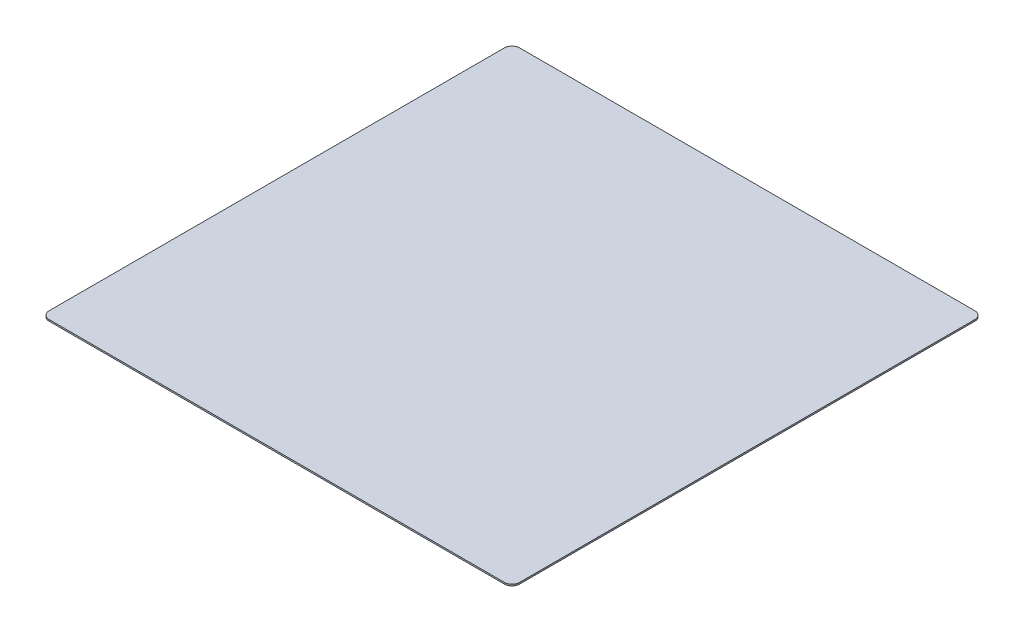
ISO-10303-21;
HEADER;
FILE_DESCRIPTION(('STEP AP214'),'2;1');
FILE_NAME('part.step','',(''),(''),'','','');
FILE_SCHEMA(('AUTOMOTIVE_DESIGN { 1 0 10303 214 1 1 1 1 }'));
ENDSEC;
DATA;
#1=APPLICATION_CONTEXT('core data for automotive mechanical design processes');
#2=APPLICATION_PROTOCOL_DEFINITION('international standard','automotive_design',2000,#1);
#3=PRODUCT_CONTEXT('',#1,'mechanical');
#4=PRODUCT('Part','Part','',(#3));
#5=PRODUCT_RELATED_PRODUCT_CATEGORY('part','',(#4));
#6=PRODUCT_DEFINITION_FORMATION('','',#4);
#7=PRODUCT_DEFINITION_CONTEXT('part definition',#1,'design');
#8=PRODUCT_DEFINITION('design','',#6,#7);
#9=PRODUCT_DEFINITION_SHAPE('','',#8);
#10=(LENGTH_UNIT() NAMED_UNIT(*) SI_UNIT(.MILLI.,.METRE.));
#11=(NAMED_UNIT(*) PLANE_ANGLE_UNIT() SI_UNIT($,.RADIAN.));
#12=(NAMED_UNIT(*) SI_UNIT($,.STERADIAN.) SOLID_ANGLE_UNIT());
#13=UNCERTAINTY_MEASURE_WITH_UNIT(LENGTH_MEASURE(1.E-05),#10,'distance_accuracy_value','');
#14=(GEOMETRIC_REPRESENTATION_CONTEXT(3) GLOBAL_UNCERTAINTY_ASSIGNED_CONTEXT((#13)) GLOBAL_UNIT_ASSIGNED_CONTEXT((#10,
#11,#12)) REPRESENTATION_CONTEXT('',''));
#15=CARTESIAN_POINT('',(0.,0.,0.));
#16=DIRECTION('',(0.,0.,1.));
#17=DIRECTION('',(1.,0.,0.));
#18=AXIS2_PLACEMENT_3D('',#15,#16,#17);
#19=CARTESIAN_POINT('',(-150.,1.,150.));
#20=DIRECTION('',(0.,-1.,0.));
#21=DIRECTION('',(0.,0.,-1.));
#22=AXIS2_PLACEMENT_3D('',#19,#20,#21);
#23=CYLINDRICAL_SURFACE('',#22,5.);
#24=CARTESIAN_POINT('',(-150.,0.,150.));
#25=DIRECTION('',(0.,1.,0.));
#26=DIRECTION('',(0.,0.,1.));
#27=AXIS2_PLACEMENT_3D('',#24,#25,#26);
#28=CIRCLE('',#27,5.);
#29=CARTESIAN_POINT('',(-155.,0.,150.));
#30=VERTEX_POINT('',#29);
#31=CARTESIAN_POINT('',(-150.,0.,155.));
#32=VERTEX_POINT('',#31);
#33=EDGE_CURVE('E130',#30,#32,#28,.T.);
#34=ORIENTED_EDGE('',*,*,#33,.T.);
#35=DIRECTION('',(0.,-1.,0.));
#36=VECTOR('',#35,1.);
#37=CARTESIAN_POINT('',(-150.,1.,155.));
#38=LINE('',#37,#36);
#39=CARTESIAN_POINT('',(-150.,1.,155.));
#40=VERTEX_POINT('',#39);
#41=EDGE_CURVE('E11',#40,#32,#38,.T.);
#42=ORIENTED_EDGE('',*,*,#41,.F.);
#43=CARTESIAN_POINT('',(-150.,1.,150.));
#44=DIRECTION('',(0.,1.,0.));
#45=DIRECTION('',(0.,0.,1.));
#46=AXIS2_PLACEMENT_3D('',#43,#44,#45);
#47=CIRCLE('',#46,5.);
#48=CARTESIAN_POINT('',(-155.,1.,150.));
#49=VERTEX_POINT('',#48);
#50=EDGE_CURVE('E144',#49,#40,#47,.T.);
#51=ORIENTED_EDGE('',*,*,#50,.F.);
#52=DIRECTION('',(0.,-1.,0.));
#53=VECTOR('',#52,1.);
#54=CARTESIAN_POINT('',(-155.,1.,150.));
#55=LINE('',#54,#53);
#56=EDGE_CURVE('E126',#49,#30,#55,.T.);
#57=ORIENTED_EDGE('',*,*,#56,.T.);
#58=EDGE_LOOP('',(#34,#42,#51,#57));
#59=FACE_BOUND('',#58,.T.);
#60=ADVANCED_FACE('F34',(#59),#23,.T.);
#61=CARTESIAN_POINT('',(-150.,1.,155.));
#62=DIRECTION('',(0.,0.,-1.));
#63=DIRECTION('',(-1.,0.,0.));
#64=AXIS2_PLACEMENT_3D('',#61,#62,#63);
#65=PLANE('',#64);
#66=DIRECTION('',(1.,0.,0.));
#67=VECTOR('',#66,1.);
#68=CARTESIAN_POINT('',(-150.,0.,155.));
#69=LINE('',#68,#67);
#70=CARTESIAN_POINT('',(150.,0.,155.));
#71=VERTEX_POINT('',#70);
#72=EDGE_CURVE('E133',#32,#71,#69,.T.);
#73=ORIENTED_EDGE('',*,*,#72,.T.);
#74=DIRECTION('',(0.,-1.,0.));
#75=VECTOR('',#74,1.);
#76=CARTESIAN_POINT('',(150.,1.,155.));
#77=LINE('',#76,#75);
#78=CARTESIAN_POINT('',(150.,1.,155.));
#79=VERTEX_POINT('',#78);
#80=EDGE_CURVE('E42',#79,#71,#77,.T.);
#81=ORIENTED_EDGE('',*,*,#80,.F.);
#82=DIRECTION('',(1.,0.,0.));
#83=VECTOR('',#82,1.);
#84=CARTESIAN_POINT('',(-150.,1.,155.));
#85=LINE('',#84,#83);
#86=EDGE_CURVE('E93',#40,#79,#85,.T.);
#87=ORIENTED_EDGE('',*,*,#86,.F.);
#88=ORIENTED_EDGE('',*,*,#41,.T.);
#89=EDGE_LOOP('',(#73,#81,#87,#88));
#90=FACE_BOUND('',#89,.T.);
#91=ADVANCED_FACE('F179',(#90),#65,.F.);
#92=CARTESIAN_POINT('',(150.,1.,150.));
#93=DIRECTION('',(0.,-1.,0.));
#94=DIRECTION('',(0.,0.,-1.));
#95=AXIS2_PLACEMENT_3D('',#92,#93,#94);
#96=CYLINDRICAL_SURFACE('',#95,5.);
#97=CARTESIAN_POINT('',(150.,0.,150.));
#98=DIRECTION('',(0.,1.,0.));
#99=DIRECTION('',(0.,0.,1.));
#100=AXIS2_PLACEMENT_3D('',#97,#98,#99);
#101=CIRCLE('',#100,5.);
#102=CARTESIAN_POINT('',(155.,0.,150.));
#103=VERTEX_POINT('',#102);
#104=EDGE_CURVE('E135',#71,#103,#101,.T.);
#105=ORIENTED_EDGE('',*,*,#104,.T.);
#106=DIRECTION('',(0.,-1.,0.));
#107=VECTOR('',#106,1.);
#108=CARTESIAN_POINT('',(155.,1.,150.));
#109=LINE('',#108,#107);
#110=CARTESIAN_POINT('',(155.,1.,150.));
#111=VERTEX_POINT('',#110);
#112=EDGE_CURVE('E151',#111,#103,#109,.T.);
#113=ORIENTED_EDGE('',*,*,#112,.F.);
#114=CARTESIAN_POINT('',(150.,1.,150.));
#115=DIRECTION('',(0.,1.,0.));
#116=DIRECTION('',(0.,0.,1.));
#117=AXIS2_PLACEMENT_3D('',#114,#115,#116);
#118=CIRCLE('',#117,5.);
#119=EDGE_CURVE('E159',#79,#111,#118,.T.);
#120=ORIENTED_EDGE('',*,*,#119,.F.);
#121=ORIENTED_EDGE('',*,*,#80,.T.);
#122=EDGE_LOOP('',(#105,#113,#120,#121));
#123=FACE_BOUND('',#122,.T.);
#124=ADVANCED_FACE('F157',(#123),#96,.T.);
#125=CARTESIAN_POINT('',(155.,1.,-150.));
#126=DIRECTION('',(-1.,0.,0.));
#127=DIRECTION('',(0.,0.,1.));
#128=AXIS2_PLACEMENT_3D('',#125,#126,#127);
#129=PLANE('',#128);
#130=DIRECTION('',(0.,0.,-1.));
#131=VECTOR('',#130,1.);
#132=CARTESIAN_POINT('',(155.,0.,-150.));
#133=LINE('',#132,#131);
#134=CARTESIAN_POINT('',(155.,0.,-150.));
#135=VERTEX_POINT('',#134);
#136=EDGE_CURVE('E137',#103,#135,#133,.T.);
#137=ORIENTED_EDGE('',*,*,#136,.T.);
#138=DIRECTION('',(0.,-1.,0.));
#139=VECTOR('',#138,1.);
#140=CARTESIAN_POINT('',(155.,1.,-150.));
#141=LINE('',#140,#139);
#142=CARTESIAN_POINT('',(155.,1.,-150.));
#143=VERTEX_POINT('',#142);
#144=EDGE_CURVE('E148',#143,#135,#141,.T.);
#145=ORIENTED_EDGE('',*,*,#144,.F.);
#146=DIRECTION('',(0.,0.,-1.));
#147=VECTOR('',#146,1.);
#148=CARTESIAN_POINT('',(155.,1.,-150.));
#149=LINE('',#148,#147);
#150=EDGE_CURVE('E171',#111,#143,#149,.T.);
#151=ORIENTED_EDGE('',*,*,#150,.F.);
#152=ORIENTED_EDGE('',*,*,#112,.T.);
#153=EDGE_LOOP('',(#137,#145,#151,#152));
#154=FACE_BOUND('',#153,.T.);
#155=ADVANCED_FACE('F167',(#154),#129,.F.);
#156=CARTESIAN_POINT('',(150.,1.,-150.));
#157=DIRECTION('',(0.,-1.,0.));
#158=DIRECTION('',(0.,0.,-1.));
#159=AXIS2_PLACEMENT_3D('',#156,#157,#158);
#160=CYLINDRICAL_SURFACE('',#159,5.);
#161=CARTESIAN_POINT('',(150.,0.,-150.));
#162=DIRECTION('',(0.,1.,0.));
#163=DIRECTION('',(0.,0.,1.));
#164=AXIS2_PLACEMENT_3D('',#161,#162,#163);
#165=CIRCLE('',#164,5.);
#166=CARTESIAN_POINT('',(150.,0.,-155.));
#167=VERTEX_POINT('',#166);
#168=EDGE_CURVE('E139',#135,#167,#165,.T.);
#169=ORIENTED_EDGE('',*,*,#168,.T.);
#170=DIRECTION('',(0.,-1.,0.));
#171=VECTOR('',#170,1.);
#172=CARTESIAN_POINT('',(150.,1.,-155.));
#173=LINE('',#172,#171);
#174=CARTESIAN_POINT('',(150.,1.,-155.));
#175=VERTEX_POINT('',#174);
#176=EDGE_CURVE('E121',#175,#167,#173,.T.);
#177=ORIENTED_EDGE('',*,*,#176,.F.);
#178=CARTESIAN_POINT('',(150.,1.,-150.));
#179=DIRECTION('',(0.,1.,0.));
#180=DIRECTION('',(0.,0.,1.));
#181=AXIS2_PLACEMENT_3D('',#178,#179,#180);
#182=CIRCLE('',#181,5.);
#183=EDGE_CURVE('E112',#143,#175,#182,.T.);
#184=ORIENTED_EDGE('',*,*,#183,.F.);
#185=ORIENTED_EDGE('',*,*,#144,.T.);
#186=EDGE_LOOP('',(#169,#177,#184,#185));
#187=FACE_BOUND('',#186,.T.);
#188=ADVANCED_FACE('F170',(#187),#160,.T.);
#189=CARTESIAN_POINT('',(-150.,1.,-155.));
#190=DIRECTION('',(0.,0.,1.));
#191=DIRECTION('',(1.,0.,0.));
#192=AXIS2_PLACEMENT_3D('',#189,#190,#191);
#193=PLANE('',#192);
#194=DIRECTION('',(-1.,0.,0.));
#195=VECTOR('',#194,1.);
#196=CARTESIAN_POINT('',(-150.,0.,-155.));
#197=LINE('',#196,#195);
#198=CARTESIAN_POINT('',(-150.,0.,-155.));
#199=VERTEX_POINT('',#198);
#200=EDGE_CURVE('E120',#167,#199,#197,.T.);
#201=ORIENTED_EDGE('',*,*,#200,.T.);
#202=DIRECTION('',(0.,-1.,0.));
#203=VECTOR('',#202,1.);
#204=CARTESIAN_POINT('',(-150.,1.,-155.));
#205=LINE('',#204,#203);
#206=CARTESIAN_POINT('',(-150.,1.,-155.));
#207=VERTEX_POINT('',#206);
#208=EDGE_CURVE('E117',#207,#199,#205,.T.);
#209=ORIENTED_EDGE('',*,*,#208,.F.);
#210=DIRECTION('',(-1.,0.,0.));
#211=VECTOR('',#210,1.);
#212=CARTESIAN_POINT('',(-150.,1.,-155.));
#213=LINE('',#212,#211);
#214=EDGE_CURVE('E106',#175,#207,#213,.T.);
#215=ORIENTED_EDGE('',*,*,#214,.F.);
#216=ORIENTED_EDGE('',*,*,#176,.T.);
#217=EDGE_LOOP('',(#201,#209,#215,#216));
#218=FACE_BOUND('',#217,.T.);
#219=ADVANCED_FACE('F118',(#218),#193,.F.);
#220=CARTESIAN_POINT('',(-150.,1.,-150.));
#221=DIRECTION('',(0.,-1.,0.));
#222=DIRECTION('',(0.,0.,-1.));
#223=AXIS2_PLACEMENT_3D('',#220,#221,#222);
#224=CYLINDRICAL_SURFACE('',#223,5.);
#225=CARTESIAN_POINT('',(-150.,0.,-150.));
#226=DIRECTION('',(0.,1.,0.));
#227=DIRECTION('',(0.,0.,1.));
#228=AXIS2_PLACEMENT_3D('',#225,#226,#227);
#229=CIRCLE('',#228,5.);
#230=CARTESIAN_POINT('',(-155.,0.,-150.));
#231=VERTEX_POINT('',#230);
#232=EDGE_CURVE('E79',#199,#231,#229,.T.);
#233=ORIENTED_EDGE('',*,*,#232,.T.);
#234=DIRECTION('',(0.,-1.,0.));
#235=VECTOR('',#234,1.);
#236=CARTESIAN_POINT('',(-155.,1.,-150.));
#237=LINE('',#236,#235);
#238=CARTESIAN_POINT('',(-155.,1.,-150.));
#239=VERTEX_POINT('',#238);
#240=EDGE_CURVE('E122',#239,#231,#237,.T.);
#241=ORIENTED_EDGE('',*,*,#240,.F.);
#242=CARTESIAN_POINT('',(-150.,1.,-150.));
#243=DIRECTION('',(0.,1.,0.));
#244=DIRECTION('',(0.,0.,1.));
#245=AXIS2_PLACEMENT_3D('',#242,#243,#244);
#246=CIRCLE('',#245,5.);
#247=EDGE_CURVE('E110',#207,#239,#246,.T.);
#248=ORIENTED_EDGE('',*,*,#247,.F.);
#249=ORIENTED_EDGE('',*,*,#208,.T.);
#250=EDGE_LOOP('',(#233,#241,#248,#249));
#251=FACE_BOUND('',#250,.T.);
#252=ADVANCED_FACE('F124',(#251),#224,.T.);
#253=CARTESIAN_POINT('',(-155.,1.,-150.));
#254=DIRECTION('',(1.,0.,0.));
#255=DIRECTION('',(0.,0.,-1.));
#256=AXIS2_PLACEMENT_3D('',#253,#254,#255);
#257=PLANE('',#256);
#258=DIRECTION('',(0.,0.,1.));
#259=VECTOR('',#258,1.);
#260=CARTESIAN_POINT('',(-155.,0.,-150.));
#261=LINE('',#260,#259);
#262=EDGE_CURVE('E85',#231,#30,#261,.T.);
#263=ORIENTED_EDGE('',*,*,#262,.T.);
#264=ORIENTED_EDGE('',*,*,#56,.F.);
#265=DIRECTION('',(0.,0.,1.));
#266=VECTOR('',#265,1.);
#267=CARTESIAN_POINT('',(-155.,1.,-150.));
#268=LINE('',#267,#266);
#269=EDGE_CURVE('E50',#239,#49,#268,.T.);
#270=ORIENTED_EDGE('',*,*,#269,.F.);
#271=ORIENTED_EDGE('',*,*,#240,.T.);
#272=EDGE_LOOP('',(#263,#264,#270,#271));
#273=FACE_BOUND('',#272,.T.);
#274=ADVANCED_FACE('F195',(#273),#257,.F.);
#275=CARTESIAN_POINT('',(-150.,1.,150.));
#276=DIRECTION('',(0.,1.,0.));
#277=DIRECTION('',(0.,0.,1.));
#278=AXIS2_PLACEMENT_3D('',#275,#276,#277);
#279=PLANE('',#278);
#280=ORIENTED_EDGE('',*,*,#50,.T.);
#281=ORIENTED_EDGE('',*,*,#86,.T.);
#282=ORIENTED_EDGE('',*,*,#119,.T.);
#283=ORIENTED_EDGE('',*,*,#150,.T.);
#284=ORIENTED_EDGE('',*,*,#183,.T.);
#285=ORIENTED_EDGE('',*,*,#214,.T.);
#286=ORIENTED_EDGE('',*,*,#247,.T.);
#287=ORIENTED_EDGE('',*,*,#269,.T.);
#288=EDGE_LOOP('',(#280,#281,#282,#283,#284,#285,#286,#287));
#289=FACE_BOUND('',#288,.T.);
#290=ADVANCED_FACE('F108',(#289),#279,.T.);
#291=CARTESIAN_POINT('',(-150.,0.,150.));
#292=DIRECTION('',(0.,1.,0.));
#293=DIRECTION('',(0.,0.,1.));
#294=AXIS2_PLACEMENT_3D('',#291,#292,#293);
#295=PLANE('',#294);
#296=ORIENTED_EDGE('',*,*,#33,.F.);
#297=ORIENTED_EDGE('',*,*,#262,.F.);
#298=ORIENTED_EDGE('',*,*,#232,.F.);
#299=ORIENTED_EDGE('',*,*,#200,.F.);
#300=ORIENTED_EDGE('',*,*,#168,.F.);
#301=ORIENTED_EDGE('',*,*,#136,.F.);
#302=ORIENTED_EDGE('',*,*,#104,.F.);
#303=ORIENTED_EDGE('',*,*,#72,.F.);
#304=EDGE_LOOP('',(#296,#297,#298,#299,#300,#301,#302,#303));
#305=FACE_BOUND('',#304,.T.);
#306=ADVANCED_FACE('F163',(#305),#295,.F.);
#307=CLOSED_SHELL('',(#60,#91,#124,#155,#188,#219,#252,#274,#290,#306));
#308=MANIFOLD_SOLID_BREP('B2',#307);
#309=ADVANCED_BREP_SHAPE_REPRESENTATION('',(#18,#308),#14);
#310=SHAPE_DEFINITION_REPRESENTATION(#9,#309);
ENDSEC;
END-ISO-10303-21;
